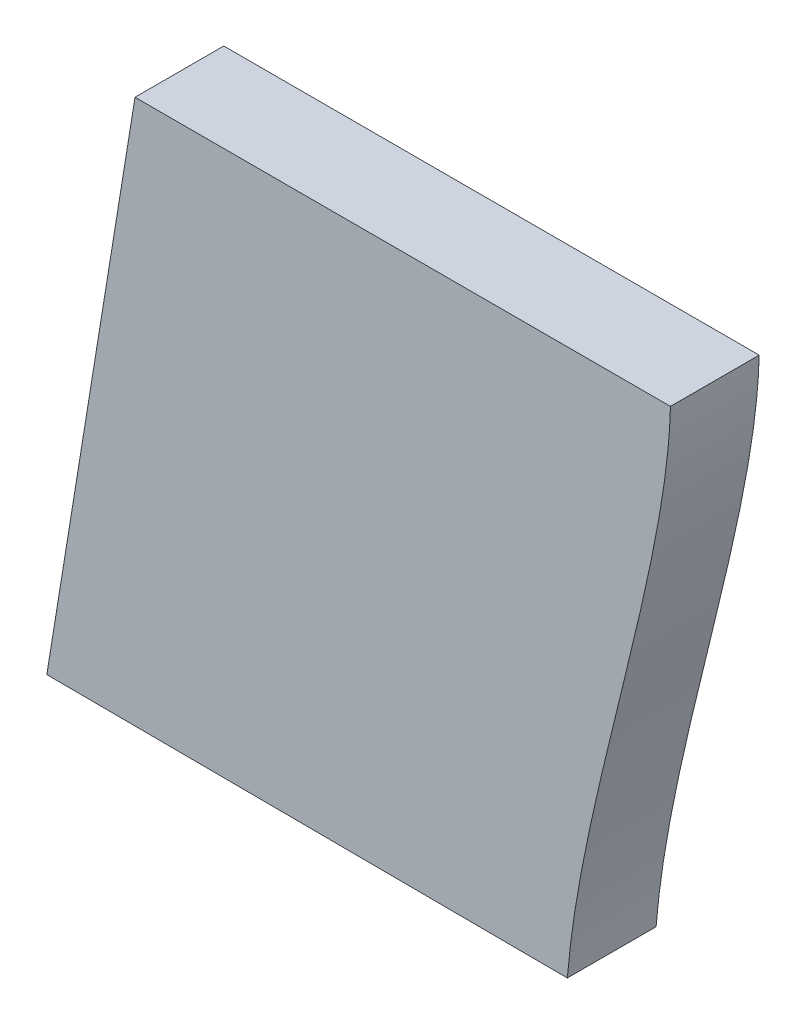
ISO-10303-21;
HEADER;
FILE_DESCRIPTION(('STEP AP214'),'2;1');
FILE_NAME('part.step','',(''),(''),'','','');
FILE_SCHEMA(('AUTOMOTIVE_DESIGN { 1 0 10303 214 1 1 1 1 }'));
ENDSEC;
DATA;
#1=APPLICATION_CONTEXT('core data for automotive mechanical design processes');
#2=APPLICATION_PROTOCOL_DEFINITION('international standard','automotive_design',2000,#1);
#3=PRODUCT_CONTEXT('',#1,'mechanical');
#4=PRODUCT('Part','Part','',(#3));
#5=PRODUCT_RELATED_PRODUCT_CATEGORY('part','',(#4));
#6=PRODUCT_DEFINITION_FORMATION('','',#4);
#7=PRODUCT_DEFINITION_CONTEXT('part definition',#1,'design');
#8=PRODUCT_DEFINITION('design','',#6,#7);
#9=PRODUCT_DEFINITION_SHAPE('','',#8);
#10=(LENGTH_UNIT() NAMED_UNIT(*) SI_UNIT(.MILLI.,.METRE.));
#11=(NAMED_UNIT(*) PLANE_ANGLE_UNIT() SI_UNIT($,.RADIAN.));
#12=(NAMED_UNIT(*) SI_UNIT($,.STERADIAN.) SOLID_ANGLE_UNIT());
#13=UNCERTAINTY_MEASURE_WITH_UNIT(LENGTH_MEASURE(1.E-05),#10,'distance_accuracy_value','');
#14=(GEOMETRIC_REPRESENTATION_CONTEXT(3) GLOBAL_UNCERTAINTY_ASSIGNED_CONTEXT((#13)) GLOBAL_UNIT_ASSIGNED_CONTEXT((#10,
#11,#12)) REPRESENTATION_CONTEXT('',''));
#15=CARTESIAN_POINT('',(0.,0.,0.));
#16=DIRECTION('',(0.,0.,1.));
#17=DIRECTION('',(1.,0.,0.));
#18=AXIS2_PLACEMENT_3D('',#15,#16,#17);
#19=CARTESIAN_POINT('',(0.0548835718536749,11.4981083051096,0.001));
#20=DIRECTION('',(0.0047732153125987,0.999988608142903,0.));
#21=DIRECTION('',(-0.999988608142903,0.0047732153125987,0.));
#22=AXIS2_PLACEMENT_3D('',#19,#20,#21);
#23=PLANE('',#22);
#24=DIRECTION('',(0.999988608142903,-0.0047732153125987,0.));
#25=VECTOR('',#24,1.);
#26=CARTESIAN_POINT('',(0.0548835718536749,11.4981083051096,0.));
#27=LINE('',#26,#25);
#28=CARTESIAN_POINT('',(50.0808239999998,11.259321,0.));
#29=VERTEX_POINT('',#28);
#30=CARTESIAN_POINT('',(50.0866899999998,11.259293,0.));
#31=VERTEX_POINT('',#30);
#32=EDGE_CURVE('E11',#29,#31,#27,.T.);
#33=ORIENTED_EDGE('',*,*,#32,.T.);
#34=DIRECTION('',(0.,0.,-1.));
#35=VECTOR('',#34,1.);
#36=CARTESIAN_POINT('',(50.0866899999998,11.259293,0.001));
#37=LINE('',#36,#35);
#38=CARTESIAN_POINT('',(50.0866899999998,11.259293,0.001));
#39=VERTEX_POINT('',#38);
#40=EDGE_CURVE('E24',#39,#31,#37,.T.);
#41=ORIENTED_EDGE('',*,*,#40,.F.);
#42=DIRECTION('',(0.999988608142903,-0.0047732153125987,0.));
#43=VECTOR('',#42,1.);
#44=CARTESIAN_POINT('',(0.0548835718536749,11.4981083051096,0.001));
#45=LINE('',#44,#43);
#46=CARTESIAN_POINT('',(50.0808239999998,11.259321,0.001));
#47=VERTEX_POINT('',#46);
#48=EDGE_CURVE('E98',#47,#39,#45,.T.);
#49=ORIENTED_EDGE('',*,*,#48,.F.);
#50=DIRECTION('',(0.,0.,-1.));
#51=VECTOR('',#50,1.);
#52=CARTESIAN_POINT('',(50.0808239999998,11.259321,0.001));
#53=LINE('',#52,#51);
#54=EDGE_CURVE('E76',#47,#29,#53,.T.);
#55=ORIENTED_EDGE('',*,*,#54,.T.);
#56=EDGE_LOOP('',(#33,#41,#49,#55));
#57=FACE_BOUND('',#56,.T.);
#58=ADVANCED_FACE('F17',(#57),#23,.F.);
#59=CARTESIAN_POINT('',(50.0866899999998,11.259293,0.001));
#60=CARTESIAN_POINT('',(50.0866899999998,11.259293,0.));
#61=CARTESIAN_POINT('',(50.0868439999998,11.261211,0.001));
#62=CARTESIAN_POINT('',(50.0868439999998,11.261211,0.));
#63=CARTESIAN_POINT('',(50.0878099999998,11.263745,0.001));
#64=CARTESIAN_POINT('',(50.0878099999998,11.263745,0.));
#65=CARTESIAN_POINT('',(50.0878519999998,11.265453,0.001));
#66=CARTESIAN_POINT('',(50.0878519999998,11.265453,0.));
#67=B_SPLINE_SURFACE_WITH_KNOTS('',3,1,((#59,#60),(#61,#62),(#63,#64),(#65,#66)),.UNSPECIFIED.,
.F.,.F.,.F.,(4,4),(2,2),(0.2,0.4),(0.,1.),.UNSPECIFIED.);
#68=CARTESIAN_POINT('',(50.0866899999998,11.259293,0.));
#69=CARTESIAN_POINT('',(50.0868439999998,11.261211,0.));
#70=CARTESIAN_POINT('',(50.0878099999998,11.263745,0.));
#71=CARTESIAN_POINT('',(50.0878519999998,11.265453,0.));
#72=B_SPLINE_CURVE_WITH_KNOTS('',3,(#68,#69,#70,#71),.UNSPECIFIED.,.F.,.F.,(4,4),(0.2,0.4),.UNSPECIFIED.);
#73=CARTESIAN_POINT('',(50.0878519999998,11.265453,0.));
#74=VERTEX_POINT('',#73);
#75=EDGE_CURVE('E89',#31,#74,#72,.T.);
#76=DIRECTION('',(0.,0.,-1.));
#77=VECTOR('',#76,1.);
#78=CARTESIAN_POINT('',(50.0878519999998,11.265453,0.001));
#79=LINE('',#78,#77);
#80=CARTESIAN_POINT('',(50.0878519999998,11.265453,0.001));
#81=VERTEX_POINT('',#80);
#82=EDGE_CURVE('E84',#81,#74,#79,.T.);
#83=CARTESIAN_POINT('',(50.0866899999998,11.259293,0.001));
#84=CARTESIAN_POINT('',(50.0868439999998,11.261211,0.001));
#85=CARTESIAN_POINT('',(50.0878099999998,11.263745,0.001));
#86=CARTESIAN_POINT('',(50.0878519999998,11.265453,0.001));
#87=B_SPLINE_CURVE_WITH_KNOTS('',3,(#83,#84,#85,#86),.UNSPECIFIED.,.F.,.F.,(4,4),(0.2,0.4),.UNSPECIFIED.);
#88=EDGE_CURVE('E70',#39,#81,#87,.T.);
#89=ORIENTED_EDGE('',*,*,#75,.T.);
#90=ORIENTED_EDGE('',*,*,#82,.F.);
#91=ORIENTED_EDGE('',*,*,#88,.F.);
#92=ORIENTED_EDGE('',*,*,#40,.T.);
#93=EDGE_LOOP('',(#89,#90,#91,#92));
#94=FACE_BOUND('',#93,.T.);
#95=ADVANCED_FACE('F100',(#94),#67,.F.);
#96=CARTESIAN_POINT('',(0.,11.265453,0.001));
#97=DIRECTION('',(0.,-1.,0.));
#98=DIRECTION('',(0.,0.,-1.));
#99=AXIS2_PLACEMENT_3D('',#96,#97,#98);
#100=PLANE('',#99);
#101=DIRECTION('',(-1.,0.,0.));
#102=VECTOR('',#101,1.);
#103=CARTESIAN_POINT('',(0.,11.265453,0.));
#104=LINE('',#103,#102);
#105=CARTESIAN_POINT('',(50.0818179999998,11.265453,0.));
#106=VERTEX_POINT('',#105);
#107=EDGE_CURVE('E59',#74,#106,#104,.T.);
#108=ORIENTED_EDGE('',*,*,#107,.T.);
#109=DIRECTION('',(0.,0.,-1.));
#110=VECTOR('',#109,1.);
#111=CARTESIAN_POINT('',(50.0818179999998,11.265453,0.001));
#112=LINE('',#111,#110);
#113=CARTESIAN_POINT('',(50.0818179999998,11.265453,0.001));
#114=VERTEX_POINT('',#113);
#115=EDGE_CURVE('E54',#114,#106,#112,.T.);
#116=ORIENTED_EDGE('',*,*,#115,.F.);
#117=DIRECTION('',(-1.,0.,0.));
#118=VECTOR('',#117,1.);
#119=CARTESIAN_POINT('',(0.,11.265453,0.001));
#120=LINE('',#119,#118);
#121=EDGE_CURVE('E57',#81,#114,#120,.T.);
#122=ORIENTED_EDGE('',*,*,#121,.F.);
#123=ORIENTED_EDGE('',*,*,#82,.T.);
#124=EDGE_LOOP('',(#108,#116,#122,#123));
#125=FACE_BOUND('',#124,.T.);
#126=ADVANCED_FACE('F56',(#125),#100,.F.);
#127=CARTESIAN_POINT('',(47.0201550905417,-7.6219886105364,0.001));
#128=DIRECTION('',(0.987115100251498,-0.160011808487609,0.));
#129=DIRECTION('',(0.160011808487609,0.987115100251498,0.));
#130=AXIS2_PLACEMENT_3D('',#127,#128,#129);
#131=PLANE('',#130);
#132=DIRECTION('',(-0.160011808487609,-0.987115100251498,0.));
#133=VECTOR('',#132,1.);
#134=CARTESIAN_POINT('',(47.0201550905417,-7.6219886105364,0.));
#135=LINE('',#134,#133);
#136=EDGE_CURVE('E72',#106,#29,#135,.T.);
#137=ORIENTED_EDGE('',*,*,#136,.T.);
#138=ORIENTED_EDGE('',*,*,#54,.F.);
#139=DIRECTION('',(-0.160011808487609,-0.987115100251498,0.));
#140=VECTOR('',#139,1.);
#141=CARTESIAN_POINT('',(47.0201550905417,-7.6219886105364,0.001));
#142=LINE('',#141,#140);
#143=EDGE_CURVE('E68',#114,#47,#142,.T.);
#144=ORIENTED_EDGE('',*,*,#143,.F.);
#145=ORIENTED_EDGE('',*,*,#115,.T.);
#146=EDGE_LOOP('',(#137,#138,#144,#145));
#147=FACE_BOUND('',#146,.T.);
#148=ADVANCED_FACE('F75',(#147),#131,.F.);
#149=CARTESIAN_POINT('',(0.,0.,0.001));
#150=DIRECTION('',(0.,0.,1.));
#151=DIRECTION('',(1.,0.,0.));
#152=AXIS2_PLACEMENT_3D('',#149,#150,#151);
#153=PLANE('',#152);
#154=ORIENTED_EDGE('',*,*,#48,.T.);
#155=ORIENTED_EDGE('',*,*,#88,.T.);
#156=ORIENTED_EDGE('',*,*,#121,.T.);
#157=ORIENTED_EDGE('',*,*,#143,.T.);
#158=EDGE_LOOP('',(#154,#155,#156,#157));
#159=FACE_BOUND('',#158,.T.);
#160=ADVANCED_FACE('F67',(#159),#153,.T.);
#161=CARTESIAN_POINT('',(0.,0.,0.));
#162=DIRECTION('',(0.,0.,1.));
#163=DIRECTION('',(1.,0.,0.));
#164=AXIS2_PLACEMENT_3D('',#161,#162,#163);
#165=PLANE('',#164);
#166=ORIENTED_EDGE('',*,*,#32,.F.);
#167=ORIENTED_EDGE('',*,*,#136,.F.);
#168=ORIENTED_EDGE('',*,*,#107,.F.);
#169=ORIENTED_EDGE('',*,*,#75,.F.);
#170=EDGE_LOOP('',(#166,#167,#168,#169));
#171=FACE_BOUND('',#170,.T.);
#172=ADVANCED_FACE('F101',(#171),#165,.F.);
#173=CLOSED_SHELL('',(#58,#95,#126,#148,#160,#172));
#174=MANIFOLD_SOLID_BREP('B1',#173);
#175=ADVANCED_BREP_SHAPE_REPRESENTATION('',(#18,#174),#14);
#176=SHAPE_DEFINITION_REPRESENTATION(#9,#175);
ENDSEC;
END-ISO-10303-21;
